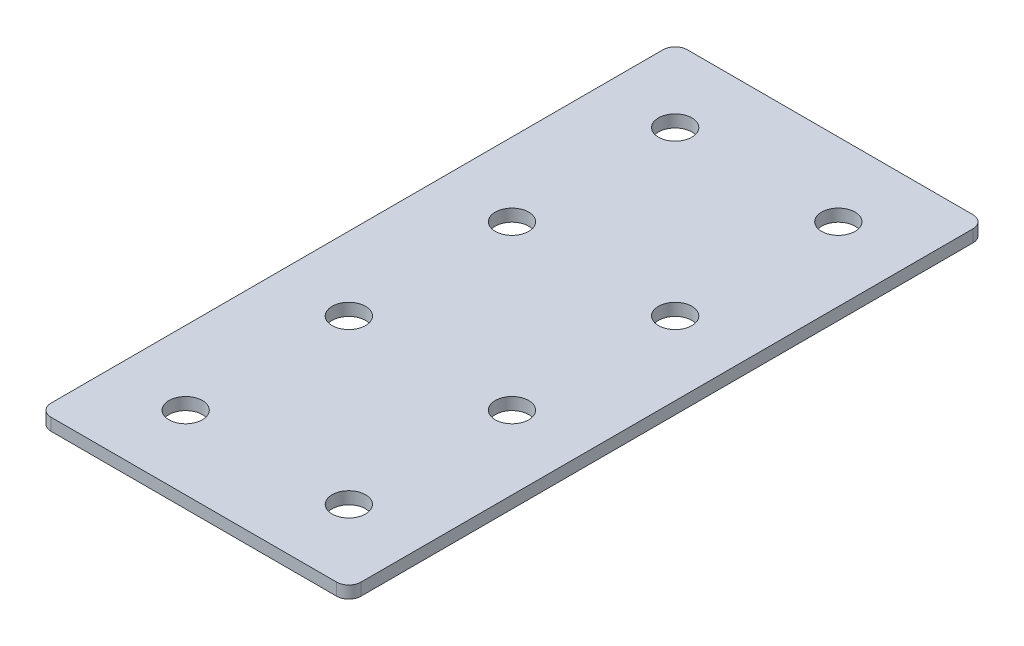
ISO-10303-21;
HEADER;
FILE_DESCRIPTION(('STEP AP214'),'2;1');
FILE_NAME('part.step','',(''),(''),'','','');
FILE_SCHEMA(('AUTOMOTIVE_DESIGN { 1 0 10303 214 1 1 1 1 }'));
ENDSEC;
DATA;
#1=APPLICATION_CONTEXT('core data for automotive mechanical design processes');
#2=APPLICATION_PROTOCOL_DEFINITION('international standard','automotive_design',2000,#1);
#3=PRODUCT_CONTEXT('',#1,'mechanical');
#4=PRODUCT('Part','Part','',(#3));
#5=PRODUCT_RELATED_PRODUCT_CATEGORY('part','',(#4));
#6=PRODUCT_DEFINITION_FORMATION('','',#4);
#7=PRODUCT_DEFINITION_CONTEXT('part definition',#1,'design');
#8=PRODUCT_DEFINITION('design','',#6,#7);
#9=PRODUCT_DEFINITION_SHAPE('','',#8);
#10=(LENGTH_UNIT() NAMED_UNIT(*) SI_UNIT(.MILLI.,.METRE.));
#11=(NAMED_UNIT(*) PLANE_ANGLE_UNIT() SI_UNIT($,.RADIAN.));
#12=(NAMED_UNIT(*) SI_UNIT($,.STERADIAN.) SOLID_ANGLE_UNIT());
#13=UNCERTAINTY_MEASURE_WITH_UNIT(LENGTH_MEASURE(1.E-05),#10,'distance_accuracy_value','');
#14=(GEOMETRIC_REPRESENTATION_CONTEXT(3) GLOBAL_UNCERTAINTY_ASSIGNED_CONTEXT((#13)) GLOBAL_UNIT_ASSIGNED_CONTEXT((#10,
#11,#12)) REPRESENTATION_CONTEXT('',''));
#15=CARTESIAN_POINT('',(0.,0.,0.));
#16=DIRECTION('',(0.,0.,1.));
#17=DIRECTION('',(1.,0.,0.));
#18=AXIS2_PLACEMENT_3D('',#15,#16,#17);
#19=CARTESIAN_POINT('',(-1.3162117550678,0.55807034319605,-60.7415241212243));
#20=DIRECTION('',(0.,-1.,0.));
#21=DIRECTION('',(0.,0.,-1.));
#22=AXIS2_PLACEMENT_3D('',#19,#20,#21);
#23=PLANE('',#22);
#24=CARTESIAN_POINT('',(18.6837882449322,0.55807034319605,59.2584758787758));
#25=DIRECTION('',(0.,1.,0.));
#26=DIRECTION('',(0.,0.,1.));
#27=AXIS2_PLACEMENT_3D('',#24,#25,#26);
#28=CIRCLE('',#27,4.1);
#29=CARTESIAN_POINT('',(18.6837882449322,0.55807034319605,63.3584758787758));
#30=VERTEX_POINT('',#29);
#31=EDGE_CURVE('E189',#30,#30,#28,.T.);
#32=ORIENTED_EDGE('',*,*,#31,.T.);
#33=EDGE_LOOP('',(#32));
#34=FACE_BOUND('',#33,.T.);
#35=CARTESIAN_POINT('',(-21.3162117550678,0.55807034319605,59.2584758787758));
#36=DIRECTION('',(0.,1.,0.));
#37=DIRECTION('',(0.,0.,1.));
#38=AXIS2_PLACEMENT_3D('',#35,#36,#37);
#39=CIRCLE('',#38,4.1);
#40=CARTESIAN_POINT('',(-21.3162117550678,0.55807034319605,63.3584758787758));
#41=VERTEX_POINT('',#40);
#42=EDGE_CURVE('E183',#41,#41,#39,.T.);
#43=ORIENTED_EDGE('',*,*,#42,.T.);
#44=EDGE_LOOP('',(#43));
#45=FACE_BOUND('',#44,.T.);
#46=CARTESIAN_POINT('',(18.6837882449322,0.55807034319605,19.2584758787757));
#47=DIRECTION('',(0.,1.,0.));
#48=DIRECTION('',(0.,0.,1.));
#49=AXIS2_PLACEMENT_3D('',#46,#47,#48);
#50=CIRCLE('',#49,4.1);
#51=CARTESIAN_POINT('',(18.6837882449322,0.55807034319605,23.3584758787757));
#52=VERTEX_POINT('',#51);
#53=EDGE_CURVE('E177',#52,#52,#50,.T.);
#54=ORIENTED_EDGE('',*,*,#53,.T.);
#55=EDGE_LOOP('',(#54));
#56=FACE_BOUND('',#55,.T.);
#57=CARTESIAN_POINT('',(-21.3162117550678,0.55807034319605,19.2584758787757));
#58=DIRECTION('',(0.,1.,0.));
#59=DIRECTION('',(0.,0.,1.));
#60=AXIS2_PLACEMENT_3D('',#57,#58,#59);
#61=CIRCLE('',#60,4.1);
#62=CARTESIAN_POINT('',(-21.3162117550678,0.55807034319605,23.3584758787757));
#63=VERTEX_POINT('',#62);
#64=EDGE_CURVE('E171',#63,#63,#61,.T.);
#65=ORIENTED_EDGE('',*,*,#64,.T.);
#66=EDGE_LOOP('',(#65));
#67=FACE_BOUND('',#66,.T.);
#68=CARTESIAN_POINT('',(18.6837882449322,0.55807034319605,-20.7415241212243));
#69=DIRECTION('',(0.,1.,0.));
#70=DIRECTION('',(0.,0.,1.));
#71=AXIS2_PLACEMENT_3D('',#68,#69,#70);
#72=CIRCLE('',#71,4.1);
#73=CARTESIAN_POINT('',(18.6837882449322,0.55807034319605,-16.6415241212243));
#74=VERTEX_POINT('',#73);
#75=EDGE_CURVE('E165',#74,#74,#72,.T.);
#76=ORIENTED_EDGE('',*,*,#75,.T.);
#77=EDGE_LOOP('',(#76));
#78=FACE_BOUND('',#77,.T.);
#79=CARTESIAN_POINT('',(-21.3162117550678,0.55807034319605,-20.7415241212243));
#80=DIRECTION('',(0.,1.,0.));
#81=DIRECTION('',(0.,0.,1.));
#82=AXIS2_PLACEMENT_3D('',#79,#80,#81);
#83=CIRCLE('',#82,4.1);
#84=CARTESIAN_POINT('',(-21.3162117550678,0.55807034319605,-16.6415241212243));
#85=VERTEX_POINT('',#84);
#86=EDGE_CURVE('E159',#85,#85,#83,.T.);
#87=ORIENTED_EDGE('',*,*,#86,.T.);
#88=EDGE_LOOP('',(#87));
#89=FACE_BOUND('',#88,.T.);
#90=CARTESIAN_POINT('',(18.6837882449322,0.55807034319605,-60.7415241212243));
#91=DIRECTION('',(0.,1.,0.));
#92=DIRECTION('',(0.,0.,1.));
#93=AXIS2_PLACEMENT_3D('',#90,#91,#92);
#94=CIRCLE('',#93,4.1);
#95=CARTESIAN_POINT('',(18.6837882449322,0.55807034319605,-56.6415241212243));
#96=VERTEX_POINT('',#95);
#97=EDGE_CURVE('E154',#96,#96,#94,.T.);
#98=ORIENTED_EDGE('',*,*,#97,.T.);
#99=EDGE_LOOP('',(#98));
#100=FACE_BOUND('',#99,.T.);
#101=CARTESIAN_POINT('',(-21.3162117550678,0.55807034319605,-60.7415241212243));
#102=DIRECTION('',(0.,1.,0.));
#103=DIRECTION('',(0.,0.,1.));
#104=AXIS2_PLACEMENT_3D('',#101,#102,#103);
#105=CIRCLE('',#104,4.1);
#106=CARTESIAN_POINT('',(-21.3162117550678,0.55807034319605,-56.6415241212243));
#107=VERTEX_POINT('',#106);
#108=EDGE_CURVE('E147',#107,#107,#105,.T.);
#109=ORIENTED_EDGE('',*,*,#108,.T.);
#110=EDGE_LOOP('',(#109));
#111=FACE_BOUND('',#110,.T.);
#112=DIRECTION('',(0.,0.,-1.));
#113=VECTOR('',#112,1.);
#114=CARTESIAN_POINT('',(36.6837882449323,0.55807034319605,77.2584758787757));
#115=LINE('',#114,#113);
#116=CARTESIAN_POINT('',(36.6837882449323,0.55807034319605,74.2584758787757));
#117=VERTEX_POINT('',#116);
#118=CARTESIAN_POINT('',(36.6837882449323,0.55807034319605,-75.7415241212243));
#119=VERTEX_POINT('',#118);
#120=EDGE_CURVE('E106',#117,#119,#115,.T.);
#121=ORIENTED_EDGE('',*,*,#120,.F.);
#122=CARTESIAN_POINT('',(33.6837882449323,0.55807034319605,74.2584758787757));
#123=DIRECTION('',(0.,-1.,0.));
#124=DIRECTION('',(0.,0.,-1.));
#125=AXIS2_PLACEMENT_3D('',#122,#123,#124);
#126=CIRCLE('',#125,3.);
#127=CARTESIAN_POINT('',(33.6837882449323,0.55807034319605,77.2584758787757));
#128=VERTEX_POINT('',#127);
#129=EDGE_CURVE('E128',#117,#128,#126,.T.);
#130=ORIENTED_EDGE('',*,*,#129,.T.);
#131=DIRECTION('',(1.,0.,0.));
#132=VECTOR('',#131,1.);
#133=CARTESIAN_POINT('',(-39.3162117550679,0.55807034319605,77.2584758787757));
#134=LINE('',#133,#132);
#135=CARTESIAN_POINT('',(-36.3162117550679,0.55807034319605,77.2584758787757));
#136=VERTEX_POINT('',#135);
#137=EDGE_CURVE('E110',#136,#128,#134,.T.);
#138=ORIENTED_EDGE('',*,*,#137,.F.);
#139=CARTESIAN_POINT('',(-36.3162117550679,0.55807034319605,74.2584758787757));
#140=DIRECTION('',(0.,-1.,0.));
#141=DIRECTION('',(0.,0.,-1.));
#142=AXIS2_PLACEMENT_3D('',#139,#140,#141);
#143=CIRCLE('',#142,3.);
#144=CARTESIAN_POINT('',(-39.3162117550679,0.55807034319605,74.2584758787757));
#145=VERTEX_POINT('',#144);
#146=EDGE_CURVE('E105',#136,#145,#143,.T.);
#147=ORIENTED_EDGE('',*,*,#146,.T.);
#148=DIRECTION('',(0.,0.,1.));
#149=VECTOR('',#148,1.);
#150=CARTESIAN_POINT('',(-39.3162117550679,0.55807034319605,-78.7415241212243));
#151=LINE('',#150,#149);
#152=CARTESIAN_POINT('',(-39.3162117550679,0.55807034319605,-75.7415241212243));
#153=VERTEX_POINT('',#152);
#154=EDGE_CURVE('E137',#153,#145,#151,.T.);
#155=ORIENTED_EDGE('',*,*,#154,.F.);
#156=CARTESIAN_POINT('',(-36.3162117550679,0.55807034319605,-75.7415241212243));
#157=DIRECTION('',(0.,-1.,0.));
#158=DIRECTION('',(0.,0.,-1.));
#159=AXIS2_PLACEMENT_3D('',#156,#157,#158);
#160=CIRCLE('',#159,3.);
#161=CARTESIAN_POINT('',(-36.3162117550679,0.55807034319605,-78.7415241212243));
#162=VERTEX_POINT('',#161);
#163=EDGE_CURVE('E31',#153,#162,#160,.T.);
#164=ORIENTED_EDGE('',*,*,#163,.T.);
#165=DIRECTION('',(-1.,0.,0.));
#166=VECTOR('',#165,1.);
#167=CARTESIAN_POINT('',(36.6837882449323,0.55807034319605,-78.7415241212243));
#168=LINE('',#167,#166);
#169=CARTESIAN_POINT('',(33.6837882449323,0.55807034319605,-78.7415241212243));
#170=VERTEX_POINT('',#169);
#171=EDGE_CURVE('E138',#170,#162,#168,.T.);
#172=ORIENTED_EDGE('',*,*,#171,.F.);
#173=CARTESIAN_POINT('',(33.6837882449323,0.55807034319605,-75.7415241212243));
#174=DIRECTION('',(0.,-1.,0.));
#175=DIRECTION('',(0.,0.,-1.));
#176=AXIS2_PLACEMENT_3D('',#173,#174,#175);
#177=CIRCLE('',#176,3.);
#178=EDGE_CURVE('E126',#170,#119,#177,.T.);
#179=ORIENTED_EDGE('',*,*,#178,.T.);
#180=EDGE_LOOP('',(#121,#130,#138,#147,#155,#164,#172,#179));
#181=FACE_BOUND('',#180,.T.);
#182=ADVANCED_FACE('F16',(#34,#45,#56,#67,#78,#89,#100,#111,#181),#23,.T.);
#183=CARTESIAN_POINT('',(36.6837882449323,0.55807034319605,-78.7415241212243));
#184=DIRECTION('',(0.,0.,-1.));
#185=DIRECTION('',(-1.,0.,0.));
#186=AXIS2_PLACEMENT_3D('',#183,#184,#185);
#187=PLANE('',#186);
#188=DIRECTION('',(-1.,0.,0.));
#189=VECTOR('',#188,1.);
#190=CARTESIAN_POINT('',(36.6837882449323,3.55807034319605,-78.7415241212243));
#191=LINE('',#190,#189);
#192=CARTESIAN_POINT('',(33.6837882449323,3.55807034319605,-78.7415241212243));
#193=VERTEX_POINT('',#192);
#194=CARTESIAN_POINT('',(-36.3162117550679,3.55807034319605,-78.7415241212243));
#195=VERTEX_POINT('',#194);
#196=EDGE_CURVE('E144',#193,#195,#191,.T.);
#197=ORIENTED_EDGE('',*,*,#196,.F.);
#198=DIRECTION('',(0.,1.,0.));
#199=VECTOR('',#198,1.);
#200=CARTESIAN_POINT('',(33.6837882449323,0.55807034319605,-78.7415241212243));
#201=LINE('',#200,#199);
#202=EDGE_CURVE('E38',#193,#170,#201,.F.);
#203=ORIENTED_EDGE('',*,*,#202,.T.);
#204=ORIENTED_EDGE('',*,*,#171,.T.);
#205=DIRECTION('',(0.,1.,0.));
#206=VECTOR('',#205,1.);
#207=CARTESIAN_POINT('',(-36.3162117550679,0.55807034319605,-78.7415241212243));
#208=LINE('',#207,#206);
#209=EDGE_CURVE('E130',#162,#195,#208,.T.);
#210=ORIENTED_EDGE('',*,*,#209,.T.);
#211=EDGE_LOOP('',(#197,#203,#204,#210));
#212=FACE_BOUND('',#211,.T.);
#213=ADVANCED_FACE('F239',(#212),#187,.T.);
#214=CARTESIAN_POINT('',(36.6837882449323,0.55807034319605,77.2584758787757));
#215=DIRECTION('',(1.,0.,0.));
#216=DIRECTION('',(0.,0.,-1.));
#217=AXIS2_PLACEMENT_3D('',#214,#215,#216);
#218=PLANE('',#217);
#219=DIRECTION('',(0.,0.,-1.));
#220=VECTOR('',#219,1.);
#221=CARTESIAN_POINT('',(36.6837882449323,3.55807034319605,77.2584758787757));
#222=LINE('',#221,#220);
#223=CARTESIAN_POINT('',(36.6837882449323,3.55807034319605,74.2584758787757));
#224=VERTEX_POINT('',#223);
#225=CARTESIAN_POINT('',(36.6837882449323,3.55807034319605,-75.7415241212243));
#226=VERTEX_POINT('',#225);
#227=EDGE_CURVE('E102',#224,#226,#222,.T.);
#228=ORIENTED_EDGE('',*,*,#227,.F.);
#229=DIRECTION('',(0.,1.,0.));
#230=VECTOR('',#229,1.);
#231=CARTESIAN_POINT('',(36.6837882449323,0.55807034319605,74.2584758787757));
#232=LINE('',#231,#230);
#233=EDGE_CURVE('E122',#224,#117,#232,.F.);
#234=ORIENTED_EDGE('',*,*,#233,.T.);
#235=ORIENTED_EDGE('',*,*,#120,.T.);
#236=DIRECTION('',(0.,1.,0.));
#237=VECTOR('',#236,1.);
#238=CARTESIAN_POINT('',(36.6837882449323,0.55807034319605,-75.7415241212243));
#239=LINE('',#238,#237);
#240=EDGE_CURVE('E119',#119,#226,#239,.T.);
#241=ORIENTED_EDGE('',*,*,#240,.T.);
#242=EDGE_LOOP('',(#228,#234,#235,#241));
#243=FACE_BOUND('',#242,.T.);
#244=ADVANCED_FACE('F244',(#243),#218,.T.);
#245=CARTESIAN_POINT('',(-39.3162117550679,0.55807034319605,77.2584758787757));
#246=DIRECTION('',(0.,0.,1.));
#247=DIRECTION('',(1.,0.,0.));
#248=AXIS2_PLACEMENT_3D('',#245,#246,#247);
#249=PLANE('',#248);
#250=ORIENTED_EDGE('',*,*,#137,.T.);
#251=DIRECTION('',(0.,1.,0.));
#252=VECTOR('',#251,1.);
#253=CARTESIAN_POINT('',(33.6837882449323,0.55807034319605,77.2584758787757));
#254=LINE('',#253,#252);
#255=CARTESIAN_POINT('',(33.6837882449323,3.55807034319605,77.2584758787757));
#256=VERTEX_POINT('',#255);
#257=EDGE_CURVE('E93',#128,#256,#254,.T.);
#258=ORIENTED_EDGE('',*,*,#257,.T.);
#259=DIRECTION('',(1.,0.,0.));
#260=VECTOR('',#259,1.);
#261=CARTESIAN_POINT('',(-39.3162117550679,3.55807034319605,77.2584758787757));
#262=LINE('',#261,#260);
#263=CARTESIAN_POINT('',(-36.3162117550679,3.55807034319605,77.2584758787757));
#264=VERTEX_POINT('',#263);
#265=EDGE_CURVE('E85',#264,#256,#262,.T.);
#266=ORIENTED_EDGE('',*,*,#265,.F.);
#267=DIRECTION('',(0.,1.,0.));
#268=VECTOR('',#267,1.);
#269=CARTESIAN_POINT('',(-36.3162117550679,0.55807034319605,77.2584758787757));
#270=LINE('',#269,#268);
#271=EDGE_CURVE('E99',#264,#136,#270,.F.);
#272=ORIENTED_EDGE('',*,*,#271,.T.);
#273=EDGE_LOOP('',(#250,#258,#266,#272));
#274=FACE_BOUND('',#273,.T.);
#275=ADVANCED_FACE('F98',(#274),#249,.T.);
#276=CARTESIAN_POINT('',(-39.3162117550679,0.55807034319605,-78.7415241212243));
#277=DIRECTION('',(-1.,0.,0.));
#278=DIRECTION('',(0.,0.,1.));
#279=AXIS2_PLACEMENT_3D('',#276,#277,#278);
#280=PLANE('',#279);
#281=DIRECTION('',(0.,0.,1.));
#282=VECTOR('',#281,1.);
#283=CARTESIAN_POINT('',(-39.3162117550679,3.55807034319605,-78.7415241212243));
#284=LINE('',#283,#282);
#285=CARTESIAN_POINT('',(-39.3162117550679,3.55807034319605,-75.7415241212243));
#286=VERTEX_POINT('',#285);
#287=CARTESIAN_POINT('',(-39.3162117550679,3.55807034319605,74.2584758787757));
#288=VERTEX_POINT('',#287);
#289=EDGE_CURVE('E87',#286,#288,#284,.T.);
#290=ORIENTED_EDGE('',*,*,#289,.F.);
#291=DIRECTION('',(0.,1.,0.));
#292=VECTOR('',#291,1.);
#293=CARTESIAN_POINT('',(-39.3162117550679,0.55807034319605,-75.7415241212243));
#294=LINE('',#293,#292);
#295=EDGE_CURVE('E10',#286,#153,#294,.F.);
#296=ORIENTED_EDGE('',*,*,#295,.T.);
#297=ORIENTED_EDGE('',*,*,#154,.T.);
#298=DIRECTION('',(0.,1.,0.));
#299=VECTOR('',#298,1.);
#300=CARTESIAN_POINT('',(-39.3162117550679,0.55807034319605,74.2584758787757));
#301=LINE('',#300,#299);
#302=EDGE_CURVE('E24',#145,#288,#301,.T.);
#303=ORIENTED_EDGE('',*,*,#302,.T.);
#304=EDGE_LOOP('',(#290,#296,#297,#303));
#305=FACE_BOUND('',#304,.T.);
#306=ADVANCED_FACE('F135',(#305),#280,.T.);
#307=CARTESIAN_POINT('',(-1.3162117550678,3.55807034319605,-60.7415241212243));
#308=DIRECTION('',(0.,-1.,0.));
#309=DIRECTION('',(0.,0.,-1.));
#310=AXIS2_PLACEMENT_3D('',#307,#308,#309);
#311=PLANE('',#310);
#312=CARTESIAN_POINT('',(18.6837882449322,3.55807034319605,59.2584758787758));
#313=DIRECTION('',(0.,1.,0.));
#314=DIRECTION('',(0.,0.,1.));
#315=AXIS2_PLACEMENT_3D('',#312,#313,#314);
#316=CIRCLE('',#315,4.1);
#317=CARTESIAN_POINT('',(18.6837882449322,3.55807034319605,63.3584758787758));
#318=VERTEX_POINT('',#317);
#319=EDGE_CURVE('E192',#318,#318,#316,.T.);
#320=ORIENTED_EDGE('',*,*,#319,.F.);
#321=EDGE_LOOP('',(#320));
#322=FACE_BOUND('',#321,.T.);
#323=CARTESIAN_POINT('',(-21.3162117550678,3.55807034319605,59.2584758787758));
#324=DIRECTION('',(0.,1.,0.));
#325=DIRECTION('',(0.,0.,1.));
#326=AXIS2_PLACEMENT_3D('',#323,#324,#325);
#327=CIRCLE('',#326,4.1);
#328=CARTESIAN_POINT('',(-21.3162117550678,3.55807034319605,63.3584758787758));
#329=VERTEX_POINT('',#328);
#330=EDGE_CURVE('E186',#329,#329,#327,.T.);
#331=ORIENTED_EDGE('',*,*,#330,.F.);
#332=EDGE_LOOP('',(#331));
#333=FACE_BOUND('',#332,.T.);
#334=CARTESIAN_POINT('',(18.6837882449322,3.55807034319605,19.2584758787757));
#335=DIRECTION('',(0.,1.,0.));
#336=DIRECTION('',(0.,0.,1.));
#337=AXIS2_PLACEMENT_3D('',#334,#335,#336);
#338=CIRCLE('',#337,4.1);
#339=CARTESIAN_POINT('',(18.6837882449322,3.55807034319605,23.3584758787757));
#340=VERTEX_POINT('',#339);
#341=EDGE_CURVE('E180',#340,#340,#338,.T.);
#342=ORIENTED_EDGE('',*,*,#341,.F.);
#343=EDGE_LOOP('',(#342));
#344=FACE_BOUND('',#343,.T.);
#345=CARTESIAN_POINT('',(-21.3162117550678,3.55807034319605,19.2584758787757));
#346=DIRECTION('',(0.,1.,0.));
#347=DIRECTION('',(0.,0.,1.));
#348=AXIS2_PLACEMENT_3D('',#345,#346,#347);
#349=CIRCLE('',#348,4.1);
#350=CARTESIAN_POINT('',(-21.3162117550678,3.55807034319605,23.3584758787757));
#351=VERTEX_POINT('',#350);
#352=EDGE_CURVE('E174',#351,#351,#349,.T.);
#353=ORIENTED_EDGE('',*,*,#352,.F.);
#354=EDGE_LOOP('',(#353));
#355=FACE_BOUND('',#354,.T.);
#356=CARTESIAN_POINT('',(18.6837882449322,3.55807034319605,-20.7415241212243));
#357=DIRECTION('',(0.,1.,0.));
#358=DIRECTION('',(0.,0.,1.));
#359=AXIS2_PLACEMENT_3D('',#356,#357,#358);
#360=CIRCLE('',#359,4.1);
#361=CARTESIAN_POINT('',(18.6837882449322,3.55807034319605,-16.6415241212243));
#362=VERTEX_POINT('',#361);
#363=EDGE_CURVE('E168',#362,#362,#360,.T.);
#364=ORIENTED_EDGE('',*,*,#363,.F.);
#365=EDGE_LOOP('',(#364));
#366=FACE_BOUND('',#365,.T.);
#367=CARTESIAN_POINT('',(-21.3162117550678,3.55807034319605,-20.7415241212243));
#368=DIRECTION('',(0.,1.,0.));
#369=DIRECTION('',(0.,0.,1.));
#370=AXIS2_PLACEMENT_3D('',#367,#368,#369);
#371=CIRCLE('',#370,4.1);
#372=CARTESIAN_POINT('',(-21.3162117550678,3.55807034319605,-16.6415241212243));
#373=VERTEX_POINT('',#372);
#374=EDGE_CURVE('E162',#373,#373,#371,.T.);
#375=ORIENTED_EDGE('',*,*,#374,.F.);
#376=EDGE_LOOP('',(#375));
#377=FACE_BOUND('',#376,.T.);
#378=CARTESIAN_POINT('',(18.6837882449322,3.55807034319605,-60.7415241212243));
#379=DIRECTION('',(0.,1.,0.));
#380=DIRECTION('',(0.,0.,1.));
#381=AXIS2_PLACEMENT_3D('',#378,#379,#380);
#382=CIRCLE('',#381,4.1);
#383=CARTESIAN_POINT('',(18.6837882449322,3.55807034319605,-56.6415241212243));
#384=VERTEX_POINT('',#383);
#385=EDGE_CURVE('E156',#384,#384,#382,.T.);
#386=ORIENTED_EDGE('',*,*,#385,.F.);
#387=EDGE_LOOP('',(#386));
#388=FACE_BOUND('',#387,.T.);
#389=CARTESIAN_POINT('',(-21.3162117550678,3.55807034319605,-60.7415241212243));
#390=DIRECTION('',(0.,1.,0.));
#391=DIRECTION('',(0.,0.,1.));
#392=AXIS2_PLACEMENT_3D('',#389,#390,#391);
#393=CIRCLE('',#392,4.1);
#394=CARTESIAN_POINT('',(-21.3162117550678,3.55807034319605,-56.6415241212243));
#395=VERTEX_POINT('',#394);
#396=EDGE_CURVE('E149',#395,#395,#393,.T.);
#397=ORIENTED_EDGE('',*,*,#396,.F.);
#398=EDGE_LOOP('',(#397));
#399=FACE_BOUND('',#398,.T.);
#400=ORIENTED_EDGE('',*,*,#265,.T.);
#401=CARTESIAN_POINT('',(33.6837882449323,3.55807034319605,74.2584758787757));
#402=DIRECTION('',(0.,-1.,0.));
#403=DIRECTION('',(0.,0.,-1.));
#404=AXIS2_PLACEMENT_3D('',#401,#402,#403);
#405=CIRCLE('',#404,3.);
#406=EDGE_CURVE('E117',#256,#224,#405,.F.);
#407=ORIENTED_EDGE('',*,*,#406,.T.);
#408=ORIENTED_EDGE('',*,*,#227,.T.);
#409=CARTESIAN_POINT('',(33.6837882449323,3.55807034319605,-75.7415241212243));
#410=DIRECTION('',(0.,-1.,0.));
#411=DIRECTION('',(0.,0.,-1.));
#412=AXIS2_PLACEMENT_3D('',#409,#410,#411);
#413=CIRCLE('',#412,3.);
#414=EDGE_CURVE('E115',#226,#193,#413,.F.);
#415=ORIENTED_EDGE('',*,*,#414,.T.);
#416=ORIENTED_EDGE('',*,*,#196,.T.);
#417=CARTESIAN_POINT('',(-36.3162117550679,3.55807034319605,-75.7415241212243));
#418=DIRECTION('',(0.,-1.,0.));
#419=DIRECTION('',(0.,0.,-1.));
#420=AXIS2_PLACEMENT_3D('',#417,#418,#419);
#421=CIRCLE('',#420,3.);
#422=EDGE_CURVE('E92',#195,#286,#421,.F.);
#423=ORIENTED_EDGE('',*,*,#422,.T.);
#424=ORIENTED_EDGE('',*,*,#289,.T.);
#425=CARTESIAN_POINT('',(-36.3162117550679,3.55807034319605,74.2584758787757));
#426=DIRECTION('',(0.,-1.,0.));
#427=DIRECTION('',(0.,0.,-1.));
#428=AXIS2_PLACEMENT_3D('',#425,#426,#427);
#429=CIRCLE('',#428,3.);
#430=EDGE_CURVE('E82',#288,#264,#429,.F.);
#431=ORIENTED_EDGE('',*,*,#430,.T.);
#432=EDGE_LOOP('',(#400,#407,#408,#415,#416,#423,#424,#431));
#433=FACE_BOUND('',#432,.T.);
#434=ADVANCED_FACE('F84',(#322,#333,#344,#355,#366,#377,#388,#399,#433),#311,.F.);
#435=CARTESIAN_POINT('',(-21.3162117550678,0.55807034319605,-60.7415241212243));
#436=DIRECTION('',(0.,1.,0.));
#437=DIRECTION('',(0.,0.,1.));
#438=AXIS2_PLACEMENT_3D('',#435,#436,#437);
#439=CYLINDRICAL_SURFACE('',#438,4.1);
#440=ORIENTED_EDGE('',*,*,#108,.F.);
#441=EDGE_LOOP('',(#440));
#442=FACE_BOUND('',#441,.T.);
#443=ORIENTED_EDGE('',*,*,#396,.T.);
#444=EDGE_LOOP('',(#443));
#445=FACE_BOUND('',#444,.T.);
#446=ADVANCED_FACE('F210',(#442,#445),#439,.F.);
#447=CARTESIAN_POINT('',(18.6837882449322,0.55807034319605,-60.7415241212243));
#448=DIRECTION('',(0.,1.,0.));
#449=DIRECTION('',(0.,0.,1.));
#450=AXIS2_PLACEMENT_3D('',#447,#448,#449);
#451=CYLINDRICAL_SURFACE('',#450,4.1);
#452=ORIENTED_EDGE('',*,*,#97,.F.);
#453=EDGE_LOOP('',(#452));
#454=FACE_BOUND('',#453,.T.);
#455=ORIENTED_EDGE('',*,*,#385,.T.);
#456=EDGE_LOOP('',(#455));
#457=FACE_BOUND('',#456,.T.);
#458=ADVANCED_FACE('F227',(#454,#457),#451,.F.);
#459=CARTESIAN_POINT('',(-21.3162117550678,0.55807034319605,-20.7415241212243));
#460=DIRECTION('',(0.,1.,0.));
#461=DIRECTION('',(0.,0.,1.));
#462=AXIS2_PLACEMENT_3D('',#459,#460,#461);
#463=CYLINDRICAL_SURFACE('',#462,4.1);
#464=ORIENTED_EDGE('',*,*,#86,.F.);
#465=EDGE_LOOP('',(#464));
#466=FACE_BOUND('',#465,.T.);
#467=ORIENTED_EDGE('',*,*,#374,.T.);
#468=EDGE_LOOP('',(#467));
#469=FACE_BOUND('',#468,.T.);
#470=ADVANCED_FACE('F234',(#466,#469),#463,.F.);
#471=CARTESIAN_POINT('',(18.6837882449322,0.55807034319605,-20.7415241212243));
#472=DIRECTION('',(0.,1.,0.));
#473=DIRECTION('',(0.,0.,1.));
#474=AXIS2_PLACEMENT_3D('',#471,#472,#473);
#475=CYLINDRICAL_SURFACE('',#474,4.1);
#476=ORIENTED_EDGE('',*,*,#75,.F.);
#477=EDGE_LOOP('',(#476));
#478=FACE_BOUND('',#477,.T.);
#479=ORIENTED_EDGE('',*,*,#363,.T.);
#480=EDGE_LOOP('',(#479));
#481=FACE_BOUND('',#480,.T.);
#482=ADVANCED_FACE('F307',(#478,#481),#475,.F.);
#483=CARTESIAN_POINT('',(-21.3162117550678,0.55807034319605,19.2584758787757));
#484=DIRECTION('',(0.,1.,0.));
#485=DIRECTION('',(0.,0.,1.));
#486=AXIS2_PLACEMENT_3D('',#483,#484,#485);
#487=CYLINDRICAL_SURFACE('',#486,4.1);
#488=ORIENTED_EDGE('',*,*,#64,.F.);
#489=EDGE_LOOP('',(#488));
#490=FACE_BOUND('',#489,.T.);
#491=ORIENTED_EDGE('',*,*,#352,.T.);
#492=EDGE_LOOP('',(#491));
#493=FACE_BOUND('',#492,.T.);
#494=ADVANCED_FACE('F317',(#490,#493),#487,.F.);
#495=CARTESIAN_POINT('',(18.6837882449322,0.55807034319605,19.2584758787757));
#496=DIRECTION('',(0.,1.,0.));
#497=DIRECTION('',(0.,0.,1.));
#498=AXIS2_PLACEMENT_3D('',#495,#496,#497);
#499=CYLINDRICAL_SURFACE('',#498,4.1);
#500=ORIENTED_EDGE('',*,*,#53,.F.);
#501=EDGE_LOOP('',(#500));
#502=FACE_BOUND('',#501,.T.);
#503=ORIENTED_EDGE('',*,*,#341,.T.);
#504=EDGE_LOOP('',(#503));
#505=FACE_BOUND('',#504,.T.);
#506=ADVANCED_FACE('F327',(#502,#505),#499,.F.);
#507=CARTESIAN_POINT('',(-21.3162117550678,0.55807034319605,59.2584758787758));
#508=DIRECTION('',(0.,1.,0.));
#509=DIRECTION('',(0.,0.,1.));
#510=AXIS2_PLACEMENT_3D('',#507,#508,#509);
#511=CYLINDRICAL_SURFACE('',#510,4.1);
#512=ORIENTED_EDGE('',*,*,#42,.F.);
#513=EDGE_LOOP('',(#512));
#514=FACE_BOUND('',#513,.T.);
#515=ORIENTED_EDGE('',*,*,#330,.T.);
#516=EDGE_LOOP('',(#515));
#517=FACE_BOUND('',#516,.T.);
#518=ADVANCED_FACE('F204',(#514,#517),#511,.F.);
#519=CARTESIAN_POINT('',(18.6837882449322,0.55807034319605,59.2584758787758));
#520=DIRECTION('',(0.,1.,0.));
#521=DIRECTION('',(0.,0.,1.));
#522=AXIS2_PLACEMENT_3D('',#519,#520,#521);
#523=CYLINDRICAL_SURFACE('',#522,4.1);
#524=ORIENTED_EDGE('',*,*,#31,.F.);
#525=EDGE_LOOP('',(#524));
#526=FACE_BOUND('',#525,.T.);
#527=ORIENTED_EDGE('',*,*,#319,.T.);
#528=EDGE_LOOP('',(#527));
#529=FACE_BOUND('',#528,.T.);
#530=ADVANCED_FACE('F200',(#526,#529),#523,.F.);
#531=CARTESIAN_POINT('',(33.6837882449323,0.55807034319605,74.2584758787757));
#532=DIRECTION('',(0.,1.,0.));
#533=DIRECTION('',(0.,0.,1.));
#534=AXIS2_PLACEMENT_3D('',#531,#532,#533);
#535=CYLINDRICAL_SURFACE('',#534,3.);
#536=ORIENTED_EDGE('',*,*,#129,.F.);
#537=ORIENTED_EDGE('',*,*,#233,.F.);
#538=ORIENTED_EDGE('',*,*,#406,.F.);
#539=ORIENTED_EDGE('',*,*,#257,.F.);
#540=EDGE_LOOP('',(#536,#537,#538,#539));
#541=FACE_BOUND('',#540,.T.);
#542=ADVANCED_FACE('F203',(#541),#535,.T.);
#543=CARTESIAN_POINT('',(33.6837882449323,0.55807034319605,-75.7415241212243));
#544=DIRECTION('',(0.,1.,0.));
#545=DIRECTION('',(0.,0.,1.));
#546=AXIS2_PLACEMENT_3D('',#543,#544,#545);
#547=CYLINDRICAL_SURFACE('',#546,3.);
#548=ORIENTED_EDGE('',*,*,#178,.F.);
#549=ORIENTED_EDGE('',*,*,#202,.F.);
#550=ORIENTED_EDGE('',*,*,#414,.F.);
#551=ORIENTED_EDGE('',*,*,#240,.F.);
#552=EDGE_LOOP('',(#548,#549,#550,#551));
#553=FACE_BOUND('',#552,.T.);
#554=ADVANCED_FACE('F249',(#553),#547,.T.);
#555=CARTESIAN_POINT('',(-36.3162117550679,0.55807034319605,-75.7415241212243));
#556=DIRECTION('',(0.,1.,0.));
#557=DIRECTION('',(0.,0.,1.));
#558=AXIS2_PLACEMENT_3D('',#555,#556,#557);
#559=CYLINDRICAL_SURFACE('',#558,3.);
#560=ORIENTED_EDGE('',*,*,#163,.F.);
#561=ORIENTED_EDGE('',*,*,#295,.F.);
#562=ORIENTED_EDGE('',*,*,#422,.F.);
#563=ORIENTED_EDGE('',*,*,#209,.F.);
#564=EDGE_LOOP('',(#560,#561,#562,#563));
#565=FACE_BOUND('',#564,.T.);
#566=ADVANCED_FACE('F252',(#565),#559,.T.);
#567=CARTESIAN_POINT('',(-36.3162117550679,0.55807034319605,74.2584758787757));
#568=DIRECTION('',(0.,1.,0.));
#569=DIRECTION('',(0.,0.,1.));
#570=AXIS2_PLACEMENT_3D('',#567,#568,#569);
#571=CYLINDRICAL_SURFACE('',#570,3.);
#572=ORIENTED_EDGE('',*,*,#146,.F.);
#573=ORIENTED_EDGE('',*,*,#271,.F.);
#574=ORIENTED_EDGE('',*,*,#430,.F.);
#575=ORIENTED_EDGE('',*,*,#302,.F.);
#576=EDGE_LOOP('',(#572,#573,#574,#575));
#577=FACE_BOUND('',#576,.T.);
#578=ADVANCED_FACE('F18',(#577),#571,.T.);
#579=CLOSED_SHELL('',(#182,#213,#244,#275,#306,#434,#446,#458,#470,#482,#494,#506,#518,#530,
#542,#554,#566,#578));
#580=MANIFOLD_SOLID_BREP('B1',#579);
#581=ADVANCED_BREP_SHAPE_REPRESENTATION('',(#18,#580),#14);
#582=SHAPE_DEFINITION_REPRESENTATION(#9,#581);
ENDSEC;
END-ISO-10303-21;
